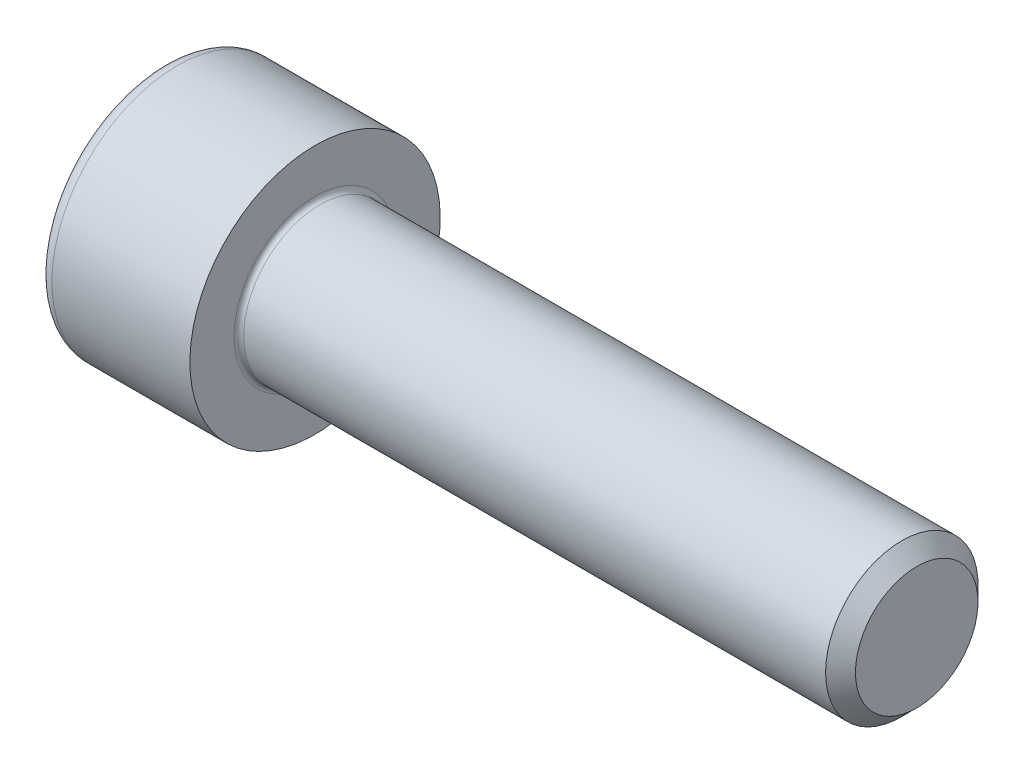
ISO-10303-21;
HEADER;
FILE_DESCRIPTION(('STEP AP214'),'2;1');
FILE_NAME('part.step','',(''),(''),'','','');
FILE_SCHEMA(('AUTOMOTIVE_DESIGN { 1 0 10303 214 1 1 1 1 }'));
ENDSEC;
DATA;
#1=APPLICATION_CONTEXT('core data for automotive mechanical design processes');
#2=APPLICATION_PROTOCOL_DEFINITION('international standard','automotive_design',2000,#1);
#3=PRODUCT_CONTEXT('',#1,'mechanical');
#4=PRODUCT('Part','Part','',(#3));
#5=PRODUCT_RELATED_PRODUCT_CATEGORY('part','',(#4));
#6=PRODUCT_DEFINITION_FORMATION('','',#4);
#7=PRODUCT_DEFINITION_CONTEXT('part definition',#1,'design');
#8=PRODUCT_DEFINITION('design','',#6,#7);
#9=PRODUCT_DEFINITION_SHAPE('','',#8);
#10=(LENGTH_UNIT() NAMED_UNIT(*) SI_UNIT(.MILLI.,.METRE.));
#11=(NAMED_UNIT(*) PLANE_ANGLE_UNIT() SI_UNIT($,.RADIAN.));
#12=(NAMED_UNIT(*) SI_UNIT($,.STERADIAN.) SOLID_ANGLE_UNIT());
#13=UNCERTAINTY_MEASURE_WITH_UNIT(LENGTH_MEASURE(1.E-05),#10,'distance_accuracy_value','');
#14=(GEOMETRIC_REPRESENTATION_CONTEXT(3) GLOBAL_UNCERTAINTY_ASSIGNED_CONTEXT((#13)) GLOBAL_UNIT_ASSIGNED_CONTEXT((#10,
#11,#12)) REPRESENTATION_CONTEXT('',''));
#15=CARTESIAN_POINT('',(0.,0.,0.));
#16=DIRECTION('',(0.,0.,1.));
#17=DIRECTION('',(1.,0.,0.));
#18=AXIS2_PLACEMENT_3D('',#15,#16,#17);
#19=CARTESIAN_POINT('',(-2.54792480126298,0.,0.));
#20=DIRECTION('',(-1.,0.,0.));
#21=DIRECTION('',(0.,0.,1.));
#22=AXIS2_PLACEMENT_3D('',#19,#20,#21);
#23=CONICAL_SURFACE('',#22,2.30141886197543,1.04719754991776);
#24=CARTESIAN_POINT('',(-1.21919999804732,-1.13686837721616E-10,0.));
#25=VERTEX_POINT('',#24);
#26=VERTEX_LOOP('',#25);
#27=FACE_BOUND('',#26,.T.);
#28=CARTESIAN_POINT('',(-2.54000000142803,1.98120000032526,1.14384635290626));
#29=CARTESIAN_POINT('',(-2.51097100848054,1.98120000011682,1.04331611318357));
#30=CARTESIAN_POINT('',(-2.48457065859602,1.98120000003131,0.941918097876422));
#31=CARTESIAN_POINT('',(-2.4384896407386,1.98119999996862,0.73736642845936));
#32=CARTESIAN_POINT('',(-2.41882527270383,1.98119999999169,0.634209141045213));
#33=CARTESIAN_POINT('',(-2.38821626617254,1.9812000000081,0.429172942767851));
#34=CARTESIAN_POINT('',(-2.37706788401862,1.98120000000216,0.327325570515035));
#35=CARTESIAN_POINT('',(-2.36376153116973,1.98119999999784,0.123151850494912));
#36=CARTESIAN_POINT('',(-2.36159253902039,1.98119999999946,0.0208262443343671));
#37=CARTESIAN_POINT('',(-2.36611630830126,1.98120000000047,-0.170358173456619));
#38=CARTESIAN_POINT('',(-2.37169833443295,1.98120000000013,-0.259245673867026));
#39=CARTESIAN_POINT('',(-2.38938650344235,1.98119999999987,-0.436441601614261));
#40=CARTESIAN_POINT('',(-2.40149868265029,1.98119999999996,-0.524749416535121));
#41=CARTESIAN_POINT('',(-2.43177678635069,1.98120000000004,-0.702310384603506));
#42=CARTESIAN_POINT('',(-2.45007099786355,1.98120000000002,-0.791541076350807));
#43=CARTESIAN_POINT('',(-2.49159112384591,1.98119999999998,-0.968671968992441));
#44=CARTESIAN_POINT('',(-2.5148072890003,1.98119999999996,-1.05657443738776));
#45=CARTESIAN_POINT('',(-2.54000000163953,1.9812,-1.14384635290124));
#46=B_SPLINE_CURVE_WITH_KNOTS('',3,(#28,#29,#30,#31,#32,#33,#34,#35,#36,#37,#38,#39,#40,#41,#42,
#43,#44,#45),.UNSPECIFIED.,.F.,.F.,(4,2,2,2,2,2,2,2,4),(0.,0.314036061113456,0.628826755288795,
0.935827354837613,1.24245102476025,1.50938492945134,1.77656600610952,2.04967187875051,
2.32224175984928),.UNSPECIFIED.);
#47=CARTESIAN_POINT('',(-2.54000000162459,1.98119999979693,1.14384635320125));
#48=VERTEX_POINT('',#47);
#49=CARTESIAN_POINT('',(-2.54000000169229,1.9812,-1.143846353084));
#50=VERTEX_POINT('',#49);
#51=EDGE_CURVE('E19',#48,#50,#46,.T.);
#52=ORIENTED_EDGE('',*,*,#51,.T.);
#53=CARTESIAN_POINT('',(-2.54000000142803,1.98119999980562,-1.14384635380629));
#54=CARTESIAN_POINT('',(-2.51097100848054,1.89413825825301,-1.19411147348712));
#55=CARTESIAN_POINT('',(-2.48457065859602,1.80632500106095,-1.24481048106664));
#56=CARTESIAN_POINT('',(-2.4384896407386,1.62917805892791,-1.34708631572088));
#57=CARTESIAN_POINT('',(-2.41882527270383,1.5398412274533,-1.39866495944794));
#58=CARTESIAN_POINT('',(-2.38821626617254,1.36227467105793,-1.50118305860083));
#59=CARTESIAN_POINT('',(-2.37706788401862,1.27407225937533,-1.55210674472209));
#60=CARTESIAN_POINT('',(-2.36376153116974,1.09725263105057,-1.65419360472841));
#61=CARTESIAN_POINT('',(-2.36159253902039,1.00863605665871,-1.70535640781009));
#62=CARTESIAN_POINT('',(-2.36611630830126,0.843065494044483,-1.80094861670645));
#63=CARTESIAN_POINT('',(-2.37169833443295,0.76608666061,-1.84539236691136));
#64=CARTESIAN_POINT('',(-2.38938650344236,0.612630485733617,-1.93399033078476));
#65=CARTESIAN_POINT('',(-2.40149868265029,0.536153674659503,-1.97814423824526));
#66=CARTESIAN_POINT('',(-2.43177678635069,0.382381365591762,-2.06692472227952));
#67=CARTESIAN_POINT('',(-2.45007099786355,0.305105319741333,-2.11154006815315));
#68=CARTESIAN_POINT('',(-2.49159112384592,0.151705466918646,-2.20010551447394));
#69=CARTESIAN_POINT('',(-2.5148072890003,0.0755796962329284,-2.24405674867158));
#70=CARTESIAN_POINT('',(-2.54000000163953,3.61344997547962E-10,-2.28769270642835));
#71=B_SPLINE_CURVE_WITH_KNOTS('',3,(#53,#54,#55,#56,#57,#58,#59,#60,#61,#62,#63,#64,#65,#66,#67,
#68,#69,#70),.UNSPECIFIED.,.F.,.F.,(4,2,2,2,2,2,2,2,4),(0.,0.314036061113456,0.628826755288795,
0.935827354837614,1.24245102476025,1.50938492945134,1.77656600610951,2.04967187875051,
2.32224175984927),.UNSPECIFIED.);
#72=CARTESIAN_POINT('',(-2.5400000016246,0.,-2.28769270640249));
#73=VERTEX_POINT('',#72);
#74=EDGE_CURVE('E79',#50,#73,#71,.T.);
#75=ORIENTED_EDGE('',*,*,#74,.T.);
#76=CARTESIAN_POINT('',(-2.54000000142803,-5.19638780479106E-10,-2.28769270671254));
#77=CARTESIAN_POINT('',(-2.51097100848054,-0.0870617418638079,-2.23742758667069));
#78=CARTESIAN_POINT('',(-2.48457065859602,-0.174874998970364,-2.18672857894306));
#79=CARTESIAN_POINT('',(-2.4384896407386,-0.35202194104071,-2.08445274418024));
#80=CARTESIAN_POINT('',(-2.41882527270384,-0.441358772538393,-2.03287410049315));
#81=CARTESIAN_POINT('',(-2.38821626617254,-0.618925328950177,-1.93035600136868));
#82=CARTESIAN_POINT('',(-2.37706788401862,-0.707127740626835,-1.87943231523712));
#83=CARTESIAN_POINT('',(-2.36376153116974,-0.883947368947275,-1.77734545522332));
#84=CARTESIAN_POINT('',(-2.36159253902039,-0.972563943340757,-1.72618265214445));
#85=CARTESIAN_POINT('',(-2.36611630830126,-1.13813450595599,-1.63059044324983));
#86=CARTESIAN_POINT('',(-2.37169833443295,-1.21511333939013,-1.58614669304433));
#87=CARTESIAN_POINT('',(-2.38938650344236,-1.36856951426626,-1.4975487291705));
#88=CARTESIAN_POINT('',(-2.40149868265029,-1.44504632534046,-1.45339482171014));
#89=CARTESIAN_POINT('',(-2.4317767863507,-1.59881863440828,-1.36461433767602));
#90=CARTESIAN_POINT('',(-2.45007099786355,-1.67609468025869,-1.31999899180235));
#91=CARTESIAN_POINT('',(-2.49159112384592,-1.82949453308134,-1.2314335454815));
#92=CARTESIAN_POINT('',(-2.5148072890003,-1.90562030376703,-1.18748231128383));
#93=CARTESIAN_POINT('',(-2.54000000163953,-1.98119999963865,-1.14384635352712));
#94=B_SPLINE_CURVE_WITH_KNOTS('',3,(#76,#77,#78,#79,#80,#81,#82,#83,#84,#85,#86,#87,#88,#89,#90,
#91,#92,#93),.UNSPECIFIED.,.F.,.F.,(4,2,2,2,2,2,2,2,4),(0.,0.314036061113457,0.628826755288796,
0.935827354837616,1.24245102476025,1.50938492945134,1.77656600610951,2.0496718787505,
2.32224175984926),.UNSPECIFIED.);
#95=CARTESIAN_POINT('',(-2.5400000016246,-1.98119999979693,-1.14384635320125));
#96=VERTEX_POINT('',#95);
#97=EDGE_CURVE('E104',#73,#96,#94,.T.);
#98=ORIENTED_EDGE('',*,*,#97,.T.);
#99=CARTESIAN_POINT('',(-2.54000000142803,-1.98120000032526,-1.14384635290626));
#100=CARTESIAN_POINT('',(-2.51097100848054,-1.98120000011682,-1.04331611318357));
#101=CARTESIAN_POINT('',(-2.48457065859602,-1.98120000003131,-0.941918097876424));
#102=CARTESIAN_POINT('',(-2.4384896407386,-1.98119999996862,-0.737366428459362));
#103=CARTESIAN_POINT('',(-2.41882527270383,-1.98119999999169,-0.634209141045214));
#104=CARTESIAN_POINT('',(-2.38821626617254,-1.9812000000081,-0.429172942767853));
#105=CARTESIAN_POINT('',(-2.37706788401862,-1.98120000000216,-0.327325570515037));
#106=CARTESIAN_POINT('',(-2.36376153116973,-1.98119999999784,-0.123151850494914));
#107=CARTESIAN_POINT('',(-2.36159253902039,-1.98119999999946,-0.020826244334369));
#108=CARTESIAN_POINT('',(-2.36611630830126,-1.98120000000047,0.170358173456617));
#109=CARTESIAN_POINT('',(-2.37169833443295,-1.98120000000013,0.259245673867024));
#110=CARTESIAN_POINT('',(-2.38938650344235,-1.98119999999987,0.436441601614259));
#111=CARTESIAN_POINT('',(-2.40149868265029,-1.98119999999996,0.52474941653512));
#112=CARTESIAN_POINT('',(-2.43177678635069,-1.98120000000004,0.702310384603505));
#113=CARTESIAN_POINT('',(-2.45007099786355,-1.98120000000002,0.791541076350806));
#114=CARTESIAN_POINT('',(-2.49159112384591,-1.98119999999998,0.96867196899244));
#115=CARTESIAN_POINT('',(-2.5148072890003,-1.98119999999996,1.05657443738776));
#116=CARTESIAN_POINT('',(-2.54000000163953,-1.9812,1.14384635290124));
#117=B_SPLINE_CURVE_WITH_KNOTS('',3,(#99,#100,#101,#102,#103,#104,#105,#106,#107,#108,#109,#110,
#111,#112,#113,#114,#115,#116),.UNSPECIFIED.,.F.,.F.,(4,2,2,2,2,2,2,2,4),(0.,0.314036061113456,
0.628826755288795,0.935827354837614,1.24245102476025,1.50938492945134,1.77656600610952,
2.04967187875052,2.32224175984928),.UNSPECIFIED.);
#118=CARTESIAN_POINT('',(-2.54000000162459,-1.98119999979693,1.14384635320125));
#119=VERTEX_POINT('',#118);
#120=EDGE_CURVE('E128',#96,#119,#117,.T.);
#121=ORIENTED_EDGE('',*,*,#120,.T.);
#122=CARTESIAN_POINT('',(-2.54000000142803,-1.98119999980562,1.14384635380629));
#123=CARTESIAN_POINT('',(-2.51097100848054,-1.89413825825301,1.19411147348712));
#124=CARTESIAN_POINT('',(-2.48457065859602,-1.80632500106095,1.24481048106664));
#125=CARTESIAN_POINT('',(-2.4384896407386,-1.62917805892791,1.34708631572088));
#126=CARTESIAN_POINT('',(-2.41882527270383,-1.5398412274533,1.39866495944794));
#127=CARTESIAN_POINT('',(-2.38821626617254,-1.36227467105793,1.50118305860083));
#128=CARTESIAN_POINT('',(-2.37706788401862,-1.27407225937533,1.55210674472209));
#129=CARTESIAN_POINT('',(-2.36376153116974,-1.09725263105057,1.65419360472841));
#130=CARTESIAN_POINT('',(-2.36159253902039,-1.00863605665871,1.70535640781009));
#131=CARTESIAN_POINT('',(-2.36611630830126,-0.843065494044483,1.80094861670645));
#132=CARTESIAN_POINT('',(-2.37169833443295,-0.76608666061,1.84539236691136));
#133=CARTESIAN_POINT('',(-2.38938650344236,-0.612630485733617,1.93399033078476));
#134=CARTESIAN_POINT('',(-2.40149868265029,-0.536153674659503,1.97814423824526));
#135=CARTESIAN_POINT('',(-2.43177678635069,-0.382381365591762,2.06692472227952));
#136=CARTESIAN_POINT('',(-2.45007099786355,-0.305105319741333,2.11154006815315));
#137=CARTESIAN_POINT('',(-2.49159112384591,-0.151705466918646,2.20010551447394));
#138=CARTESIAN_POINT('',(-2.5148072890003,-0.0755796962329291,2.24405674867158));
#139=CARTESIAN_POINT('',(-2.54000000163953,-3.61345646756782E-10,2.28769270642835));
#140=B_SPLINE_CURVE_WITH_KNOTS('',3,(#122,#123,#124,#125,#126,#127,#128,#129,#130,#131,#132,
#133,#134,#135,#136,#137,#138,#139),.UNSPECIFIED.,.F.,.F.,(4,2,2,2,2,2,2,2,4),(0.,
0.314036061113456,0.628826755288795,0.935827354837614,1.24245102476025,1.50938492945134,
1.77656600610951,2.04967187875051,2.32224175984927),.UNSPECIFIED.);
#141=CARTESIAN_POINT('',(-2.5400000016246,0.,2.28769270640249));
#142=VERTEX_POINT('',#141);
#143=EDGE_CURVE('E136',#119,#142,#140,.T.);
#144=ORIENTED_EDGE('',*,*,#143,.T.);
#145=CARTESIAN_POINT('',(-2.54000000142803,5.19638028011952E-10,2.28769270671254));
#146=CARTESIAN_POINT('',(-2.51097100848054,0.0870617418638069,2.23742758667069));
#147=CARTESIAN_POINT('',(-2.48457065859602,0.174874998970363,2.18672857894306));
#148=CARTESIAN_POINT('',(-2.4384896407386,0.352021941040709,2.08445274418023));
#149=CARTESIAN_POINT('',(-2.41882527270384,0.441358772538392,2.03287410049314));
#150=CARTESIAN_POINT('',(-2.38821626617254,0.618925328950176,1.93035600136868));
#151=CARTESIAN_POINT('',(-2.37706788401862,0.707127740626834,1.87943231523712));
#152=CARTESIAN_POINT('',(-2.36376153116974,0.883947368947274,1.77734545522332));
#153=CARTESIAN_POINT('',(-2.36159253902039,0.972563943340755,1.72618265214445));
#154=CARTESIAN_POINT('',(-2.36611630830126,1.13813450595599,1.63059044324983));
#155=CARTESIAN_POINT('',(-2.37169833443295,1.21511333939013,1.58614669304433));
#156=CARTESIAN_POINT('',(-2.38938650344236,1.36856951426626,1.49754872917049));
#157=CARTESIAN_POINT('',(-2.40149868265029,1.44504632534046,1.45339482171014));
#158=CARTESIAN_POINT('',(-2.43177678635069,1.59881863440828,1.36461433767602));
#159=CARTESIAN_POINT('',(-2.45007099786355,1.67609468025869,1.31999899180235));
#160=CARTESIAN_POINT('',(-2.49159112384592,1.82949453308134,1.2314335454815));
#161=CARTESIAN_POINT('',(-2.5148072890003,1.90562030376703,1.18748231128382));
#162=CARTESIAN_POINT('',(-2.54000000163953,1.98119999963865,1.14384635352712));
#163=B_SPLINE_CURVE_WITH_KNOTS('',3,(#145,#146,#147,#148,#149,#150,#151,#152,#153,#154,#155,
#156,#157,#158,#159,#160,#161,#162),.UNSPECIFIED.,.F.,.F.,(4,2,2,2,2,2,2,2,4),(0.,
0.314036061113457,0.628826755288796,0.935827354837616,1.24245102476025,1.50938492945134,
1.77656600610951,2.04967187875051,2.32224175984927),.UNSPECIFIED.);
#164=EDGE_CURVE('E81',#142,#48,#163,.T.);
#165=ORIENTED_EDGE('',*,*,#164,.T.);
#166=EDGE_LOOP('',(#52,#75,#98,#121,#144,#165));
#167=FACE_BOUND('',#166,.T.);
#168=ADVANCED_FACE('F15',(#27,#167),#23,.F.);
#169=CARTESIAN_POINT('',(-4.826,1.9812,1.14384635331849));
#170=DIRECTION('',(0.,1.,0.));
#171=DIRECTION('',(0.,0.,1.));
#172=AXIS2_PLACEMENT_3D('',#169,#170,#171);
#173=PLANE('',#172);
#174=DIRECTION('',(1.,0.,0.));
#175=VECTOR('',#174,1.);
#176=CARTESIAN_POINT('',(-4.826,1.9812,1.14384635331849));
#177=LINE('',#176,#175);
#178=CARTESIAN_POINT('',(-4.826,1.9812,1.14384635331849));
#179=VERTEX_POINT('',#178);
#180=EDGE_CURVE('E83',#48,#179,#177,.F.);
#181=ORIENTED_EDGE('',*,*,#180,.T.);
#182=DIRECTION('',(0.,0.,1.));
#183=VECTOR('',#182,1.);
#184=CARTESIAN_POINT('',(-4.826,1.9812,0.));
#185=LINE('',#184,#183);
#186=CARTESIAN_POINT('',(-4.826,1.9812,-1.14384635331849));
#187=VERTEX_POINT('',#186);
#188=EDGE_CURVE('E88',#187,#179,#185,.T.);
#189=ORIENTED_EDGE('',*,*,#188,.F.);
#190=DIRECTION('',(1.,0.,0.));
#191=VECTOR('',#190,1.);
#192=CARTESIAN_POINT('',(-4.826,1.9812,-1.14384635331849));
#193=LINE('',#192,#191);
#194=EDGE_CURVE('E86',#187,#50,#193,.T.);
#195=ORIENTED_EDGE('',*,*,#194,.T.);
#196=ORIENTED_EDGE('',*,*,#51,.F.);
#197=EDGE_LOOP('',(#181,#189,#195,#196));
#198=FACE_BOUND('',#197,.T.);
#199=ADVANCED_FACE('F75',(#198),#173,.F.);
#200=CARTESIAN_POINT('',(-4.826,0.,2.28769270663698));
#201=DIRECTION('',(0.,0.500000000000001,0.866025403784438));
#202=DIRECTION('',(0.,-0.866025403784438,0.500000000000001));
#203=AXIS2_PLACEMENT_3D('',#200,#201,#202);
#204=PLANE('',#203);
#205=DIRECTION('',(1.,0.,0.));
#206=VECTOR('',#205,1.);
#207=CARTESIAN_POINT('',(-4.826,0.,2.28769270663698));
#208=LINE('',#207,#206);
#209=CARTESIAN_POINT('',(-4.826,0.,2.28769270663698));
#210=VERTEX_POINT('',#209);
#211=EDGE_CURVE('E140',#142,#210,#208,.F.);
#212=ORIENTED_EDGE('',*,*,#211,.T.);
#213=DIRECTION('',(0.,-0.866025403784438,0.500000000000002));
#214=VECTOR('',#213,1.);
#215=CARTESIAN_POINT('',(-4.826,1.9812,1.14384635331849));
#216=LINE('',#215,#214);
#217=EDGE_CURVE('E94',#179,#210,#216,.T.);
#218=ORIENTED_EDGE('',*,*,#217,.F.);
#219=ORIENTED_EDGE('',*,*,#180,.F.);
#220=ORIENTED_EDGE('',*,*,#164,.F.);
#221=EDGE_LOOP('',(#212,#218,#219,#220));
#222=FACE_BOUND('',#221,.T.);
#223=ADVANCED_FACE('F144',(#222),#204,.F.);
#224=CARTESIAN_POINT('',(-4.826,-1.9812,1.14384635331849));
#225=DIRECTION('',(0.,-0.5,0.866025403784439));
#226=DIRECTION('',(0.,-0.866025403784439,-0.5));
#227=AXIS2_PLACEMENT_3D('',#224,#225,#226);
#228=PLANE('',#227);
#229=DIRECTION('',(1.,0.,0.));
#230=VECTOR('',#229,1.);
#231=CARTESIAN_POINT('',(-4.826,-1.9812,1.14384635331849));
#232=LINE('',#231,#230);
#233=CARTESIAN_POINT('',(-4.826,-1.9812,1.14384635331849));
#234=VERTEX_POINT('',#233);
#235=EDGE_CURVE('E135',#119,#234,#232,.F.);
#236=ORIENTED_EDGE('',*,*,#235,.T.);
#237=DIRECTION('',(0.,-0.866025403784438,-0.500000000000002));
#238=VECTOR('',#237,1.);
#239=CARTESIAN_POINT('',(-4.826,0.,2.28769270663698));
#240=LINE('',#239,#238);
#241=EDGE_CURVE('E245',#210,#234,#240,.T.);
#242=ORIENTED_EDGE('',*,*,#241,.F.);
#243=ORIENTED_EDGE('',*,*,#211,.F.);
#244=ORIENTED_EDGE('',*,*,#143,.F.);
#245=EDGE_LOOP('',(#236,#242,#243,#244));
#246=FACE_BOUND('',#245,.T.);
#247=ADVANCED_FACE('F124',(#246),#228,.F.);
#248=CARTESIAN_POINT('',(-4.826,-1.9812,-1.14384635331849));
#249=DIRECTION('',(0.,-1.,0.));
#250=DIRECTION('',(0.,0.,-1.));
#251=AXIS2_PLACEMENT_3D('',#248,#249,#250);
#252=PLANE('',#251);
#253=DIRECTION('',(1.,0.,0.));
#254=VECTOR('',#253,1.);
#255=CARTESIAN_POINT('',(-4.826,-1.9812,-1.1438463533185));
#256=LINE('',#255,#254);
#257=CARTESIAN_POINT('',(-4.826,-1.9812,-1.14384635331849));
#258=VERTEX_POINT('',#257);
#259=EDGE_CURVE('E134',#96,#258,#256,.F.);
#260=ORIENTED_EDGE('',*,*,#259,.T.);
#261=DIRECTION('',(0.,0.,1.));
#262=VECTOR('',#261,1.);
#263=CARTESIAN_POINT('',(-4.826,-1.9812,0.));
#264=LINE('',#263,#262);
#265=EDGE_CURVE('E242',#234,#258,#264,.F.);
#266=ORIENTED_EDGE('',*,*,#265,.F.);
#267=ORIENTED_EDGE('',*,*,#235,.F.);
#268=ORIENTED_EDGE('',*,*,#120,.F.);
#269=EDGE_LOOP('',(#260,#266,#267,#268));
#270=FACE_BOUND('',#269,.T.);
#271=ADVANCED_FACE('F120',(#270),#252,.F.);
#272=CARTESIAN_POINT('',(-4.826,0.,-2.28769270663698));
#273=DIRECTION('',(0.,-0.5,-0.866025403784439));
#274=DIRECTION('',(0.,0.866025403784439,-0.5));
#275=AXIS2_PLACEMENT_3D('',#272,#273,#274);
#276=PLANE('',#275);
#277=DIRECTION('',(1.,0.,0.));
#278=VECTOR('',#277,1.);
#279=CARTESIAN_POINT('',(-4.826,0.,-2.28769270663698));
#280=LINE('',#279,#278);
#281=CARTESIAN_POINT('',(-4.826,0.,-2.28769270663698));
#282=VERTEX_POINT('',#281);
#283=EDGE_CURVE('E37',#73,#282,#280,.F.);
#284=ORIENTED_EDGE('',*,*,#283,.T.);
#285=DIRECTION('',(0.,0.866025403784438,-0.500000000000002));
#286=VECTOR('',#285,1.);
#287=CARTESIAN_POINT('',(-4.826,-1.9812,-1.14384635331849));
#288=LINE('',#287,#286);
#289=EDGE_CURVE('E239',#258,#282,#288,.T.);
#290=ORIENTED_EDGE('',*,*,#289,.F.);
#291=ORIENTED_EDGE('',*,*,#259,.F.);
#292=ORIENTED_EDGE('',*,*,#97,.F.);
#293=EDGE_LOOP('',(#284,#290,#291,#292));
#294=FACE_BOUND('',#293,.T.);
#295=ADVANCED_FACE('F114',(#294),#276,.F.);
#296=CARTESIAN_POINT('',(-4.826,1.9812,-1.14384635331849));
#297=DIRECTION('',(0.,0.5,-0.866025403784439));
#298=DIRECTION('',(0.,0.866025403784439,0.5));
#299=AXIS2_PLACEMENT_3D('',#296,#297,#298);
#300=PLANE('',#299);
#301=ORIENTED_EDGE('',*,*,#194,.F.);
#302=DIRECTION('',(0.,0.866025403784438,0.500000000000002));
#303=VECTOR('',#302,1.);
#304=CARTESIAN_POINT('',(-4.826,0.,-2.28769270663698));
#305=LINE('',#304,#303);
#306=EDGE_CURVE('E237',#282,#187,#305,.T.);
#307=ORIENTED_EDGE('',*,*,#306,.F.);
#308=ORIENTED_EDGE('',*,*,#283,.F.);
#309=ORIENTED_EDGE('',*,*,#74,.F.);
#310=EDGE_LOOP('',(#301,#307,#308,#309));
#311=FACE_BOUND('',#310,.T.);
#312=ADVANCED_FACE('F92',(#311),#300,.F.);
#313=CARTESIAN_POINT('',(-4.826,3.12504635331849,0.));
#314=DIRECTION('',(-1.,0.,0.));
#315=DIRECTION('',(0.,0.,1.));
#316=AXIS2_PLACEMENT_3D('',#313,#314,#315);
#317=PLANE('',#316);
#318=ORIENTED_EDGE('',*,*,#289,.T.);
#319=ORIENTED_EDGE('',*,*,#306,.T.);
#320=ORIENTED_EDGE('',*,*,#188,.T.);
#321=ORIENTED_EDGE('',*,*,#217,.T.);
#322=ORIENTED_EDGE('',*,*,#241,.T.);
#323=ORIENTED_EDGE('',*,*,#265,.T.);
#324=EDGE_LOOP('',(#318,#319,#320,#321,#322,#323));
#325=FACE_BOUND('',#324,.T.);
#326=CARTESIAN_POINT('',(-4.826,0.,0.));
#327=DIRECTION('',(1.,0.,0.));
#328=DIRECTION('',(0.,1.,0.));
#329=AXIS2_PLACEMENT_3D('',#326,#327,#328);
#330=CIRCLE('',#329,3.5052);
#331=CARTESIAN_POINT('',(-4.826,3.5052,0.));
#332=VERTEX_POINT('',#331);
#333=EDGE_CURVE('E214',#332,#332,#330,.T.);
#334=ORIENTED_EDGE('',*,*,#333,.F.);
#335=EDGE_LOOP('',(#334));
#336=FACE_BOUND('',#335,.T.);
#337=ADVANCED_FACE('F113',(#325,#336),#317,.T.);
#338=CARTESIAN_POINT('',(-4.3688,0.,0.));
#339=DIRECTION('',(1.,0.,0.));
#340=DIRECTION('',(0.,0.,-1.));
#341=AXIS2_PLACEMENT_3D('',#338,#339,#340);
#342=TOROIDAL_SURFACE('',#341,3.5052,0.4572);
#343=CARTESIAN_POINT('',(-4.3688,0.,0.));
#344=DIRECTION('',(1.,0.,0.));
#345=DIRECTION('',(0.,1.,0.));
#346=AXIS2_PLACEMENT_3D('',#343,#344,#345);
#347=CIRCLE('',#346,3.9624);
#348=CARTESIAN_POINT('',(-4.3688,3.9624,0.));
#349=VERTEX_POINT('',#348);
#350=EDGE_CURVE('E254',#349,#349,#347,.T.);
#351=ORIENTED_EDGE('',*,*,#350,.F.);
#352=EDGE_LOOP('',(#351));
#353=FACE_BOUND('',#352,.T.);
#354=ORIENTED_EDGE('',*,*,#333,.T.);
#355=EDGE_LOOP('',(#354));
#356=FACE_BOUND('',#355,.T.);
#357=ADVANCED_FACE('F198',(#353,#356),#342,.T.);
#358=CARTESIAN_POINT('',(-2.413,0.,0.));
#359=DIRECTION('',(1.,0.,0.));
#360=DIRECTION('',(0.,1.,0.));
#361=AXIS2_PLACEMENT_3D('',#358,#359,#360);
#362=CYLINDRICAL_SURFACE('',#361,3.9624);
#363=ORIENTED_EDGE('',*,*,#350,.T.);
#364=EDGE_LOOP('',(#363));
#365=FACE_BOUND('',#364,.T.);
#366=CARTESIAN_POINT('',(0.,0.,0.));
#367=DIRECTION('',(1.,0.,0.));
#368=DIRECTION('',(0.,1.,0.));
#369=AXIS2_PLACEMENT_3D('',#366,#367,#368);
#370=CIRCLE('',#369,3.9624);
#371=CARTESIAN_POINT('',(0.,3.9624,0.));
#372=VERTEX_POINT('',#371);
#373=EDGE_CURVE('E102',#372,#372,#370,.T.);
#374=ORIENTED_EDGE('',*,*,#373,.F.);
#375=EDGE_LOOP('',(#374));
#376=FACE_BOUND('',#375,.T.);
#377=ADVANCED_FACE('F195',(#365,#376),#362,.T.);
#378=CARTESIAN_POINT('',(19.05,1.2065,0.));
#379=DIRECTION('',(1.,0.,0.));
#380=DIRECTION('',(0.,0.,-1.));
#381=AXIS2_PLACEMENT_3D('',#378,#379,#380);
#382=PLANE('',#381);
#383=CARTESIAN_POINT('',(19.0500000002203,0.,0.));
#384=DIRECTION('',(-1.,0.,0.));
#385=DIRECTION('',(0.,0.,1.));
#386=AXIS2_PLACEMENT_3D('',#383,#384,#385);
#387=CIRCLE('',#386,1.94056000026421);
#388=CARTESIAN_POINT('',(19.0500000002203,0.,1.94056000026421));
#389=VERTEX_POINT('',#388);
#390=EDGE_CURVE('E249',#389,#389,#387,.T.);
#391=ORIENTED_EDGE('',*,*,#390,.F.);
#392=EDGE_LOOP('',(#391));
#393=FACE_BOUND('',#392,.T.);
#394=ADVANCED_FACE('F192',(#393),#382,.T.);
#395=CARTESIAN_POINT('',(0.,3.1877,0.));
#396=DIRECTION('',(1.,0.,0.));
#397=DIRECTION('',(0.,0.,-1.));
#398=AXIS2_PLACEMENT_3D('',#395,#396,#397);
#399=PLANE('',#398);
#400=CARTESIAN_POINT('',(0.,0.,0.));
#401=DIRECTION('',(1.,0.,0.));
#402=DIRECTION('',(0.,1.,0.));
#403=AXIS2_PLACEMENT_3D('',#400,#401,#402);
#404=CIRCLE('',#403,2.5654);
#405=CARTESIAN_POINT('',(0.,2.5654,0.));
#406=VERTEX_POINT('',#405);
#407=EDGE_CURVE('E179',#406,#406,#404,.F.);
#408=ORIENTED_EDGE('',*,*,#407,.T.);
#409=EDGE_LOOP('',(#408));
#410=FACE_BOUND('',#409,.T.);
#411=ORIENTED_EDGE('',*,*,#373,.T.);
#412=EDGE_LOOP('',(#411));
#413=FACE_BOUND('',#412,.T.);
#414=ADVANCED_FACE('F183',(#410,#413),#399,.T.);
#415=CARTESIAN_POINT('',(18.5775599999261,0.,0.));
#416=DIRECTION('',(-1.,0.,0.));
#417=DIRECTION('',(0.,0.,1.));
#418=AXIS2_PLACEMENT_3D('',#415,#416,#417);
#419=CONICAL_SURFACE('',#418,2.41299999970579,0.785398162495057);
#420=ORIENTED_EDGE('',*,*,#390,.T.);
#421=EDGE_LOOP('',(#420));
#422=FACE_BOUND('',#421,.T.);
#423=CARTESIAN_POINT('',(18.57756,0.,0.));
#424=DIRECTION('',(1.,0.,0.));
#425=DIRECTION('',(0.,1.,0.));
#426=AXIS2_PLACEMENT_3D('',#423,#424,#425);
#427=CIRCLE('',#426,2.413);
#428=CARTESIAN_POINT('',(18.57756,2.413,0.));
#429=VERTEX_POINT('',#428);
#430=EDGE_CURVE('E28',#429,#429,#427,.F.);
#431=ORIENTED_EDGE('',*,*,#430,.F.);
#432=EDGE_LOOP('',(#431));
#433=FACE_BOUND('',#432,.T.);
#434=ADVANCED_FACE('F161',(#422,#433),#419,.T.);
#435=CARTESIAN_POINT('',(0.1524,0.,0.));
#436=DIRECTION('',(1.,0.,0.));
#437=DIRECTION('',(0.,0.,-1.));
#438=AXIS2_PLACEMENT_3D('',#435,#436,#437);
#439=TOROIDAL_SURFACE('',#438,2.5654,0.1524);
#440=CARTESIAN_POINT('',(0.1524,0.,0.));
#441=DIRECTION('',(1.,0.,0.));
#442=DIRECTION('',(0.,1.,0.));
#443=AXIS2_PLACEMENT_3D('',#440,#441,#442);
#444=CIRCLE('',#443,2.413);
#445=CARTESIAN_POINT('',(0.1524,2.413,0.));
#446=VERTEX_POINT('',#445);
#447=EDGE_CURVE('E9',#446,#446,#444,.T.);
#448=ORIENTED_EDGE('',*,*,#447,.F.);
#449=EDGE_LOOP('',(#448));
#450=FACE_BOUND('',#449,.T.);
#451=ORIENTED_EDGE('',*,*,#407,.F.);
#452=EDGE_LOOP('',(#451));
#453=FACE_BOUND('',#452,.T.);
#454=ADVANCED_FACE('F155',(#450,#453),#439,.F.);
#455=CARTESIAN_POINT('',(10.1204759998,0.,0.));
#456=DIRECTION('',(1.,0.,0.));
#457=DIRECTION('',(0.,1.,0.));
#458=AXIS2_PLACEMENT_3D('',#455,#456,#457);
#459=CYLINDRICAL_SURFACE('',#458,2.413);
#460=ORIENTED_EDGE('',*,*,#447,.T.);
#461=EDGE_LOOP('',(#460));
#462=FACE_BOUND('',#461,.T.);
#463=ORIENTED_EDGE('',*,*,#430,.T.);
#464=EDGE_LOOP('',(#463));
#465=FACE_BOUND('',#464,.T.);
#466=ADVANCED_FACE('F153',(#462,#465),#459,.T.);
#467=CLOSED_SHELL('',(#168,#199,#223,#247,#271,#295,#312,#337,#357,#377,#394,#414,#434,#454,#466));
#468=MANIFOLD_SOLID_BREP('B1',#467);
#469=ADVANCED_BREP_SHAPE_REPRESENTATION('',(#18,#468),#14);
#470=SHAPE_DEFINITION_REPRESENTATION(#9,#469);
ENDSEC;
END-ISO-10303-21;
